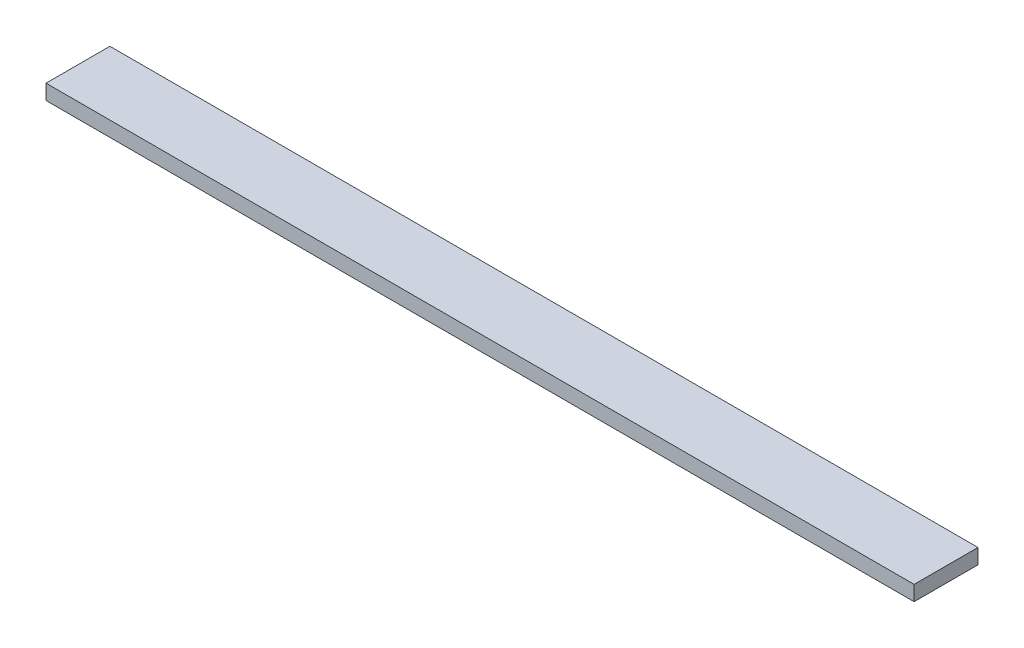
ISO-10303-21;
HEADER;
FILE_DESCRIPTION(('STEP AP214'),'2;1');
FILE_NAME('part.step','',(''),(''),'','','');
FILE_SCHEMA(('AUTOMOTIVE_DESIGN { 1 0 10303 214 1 1 1 1 }'));
ENDSEC;
DATA;
#1=APPLICATION_CONTEXT('core data for automotive mechanical design processes');
#2=APPLICATION_PROTOCOL_DEFINITION('international standard','automotive_design',2000,#1);
#3=PRODUCT_CONTEXT('',#1,'mechanical');
#4=PRODUCT('Part','Part','',(#3));
#5=PRODUCT_RELATED_PRODUCT_CATEGORY('part','',(#4));
#6=PRODUCT_DEFINITION_FORMATION('','',#4);
#7=PRODUCT_DEFINITION_CONTEXT('part definition',#1,'design');
#8=PRODUCT_DEFINITION('design','',#6,#7);
#9=PRODUCT_DEFINITION_SHAPE('','',#8);
#10=(LENGTH_UNIT() NAMED_UNIT(*) SI_UNIT(.MILLI.,.METRE.));
#11=(NAMED_UNIT(*) PLANE_ANGLE_UNIT() SI_UNIT($,.RADIAN.));
#12=(NAMED_UNIT(*) SI_UNIT($,.STERADIAN.) SOLID_ANGLE_UNIT());
#13=UNCERTAINTY_MEASURE_WITH_UNIT(LENGTH_MEASURE(1.E-05),#10,'distance_accuracy_value','');
#14=(GEOMETRIC_REPRESENTATION_CONTEXT(3) GLOBAL_UNCERTAINTY_ASSIGNED_CONTEXT((#13)) GLOBAL_UNIT_ASSIGNED_CONTEXT((#10,
#11,#12)) REPRESENTATION_CONTEXT('',''));
#15=CARTESIAN_POINT('',(0.,0.,0.));
#16=DIRECTION('',(0.,0.,1.));
#17=DIRECTION('',(1.,0.,0.));
#18=AXIS2_PLACEMENT_3D('',#15,#16,#17);
#19=CARTESIAN_POINT('',(5775.,200.,-425.));
#20=DIRECTION('',(-1.,0.,0.));
#21=DIRECTION('',(0.,0.,1.));
#22=AXIS2_PLACEMENT_3D('',#19,#20,#21);
#23=PLANE('',#22);
#24=DIRECTION('',(0.,0.,-1.));
#25=VECTOR('',#24,1.);
#26=CARTESIAN_POINT('',(5775.,0.,-425.));
#27=LINE('',#26,#25);
#28=CARTESIAN_POINT('',(5775.,0.,425.));
#29=VERTEX_POINT('',#28);
#30=CARTESIAN_POINT('',(5775.,0.,-425.));
#31=VERTEX_POINT('',#30);
#32=EDGE_CURVE('E95',#29,#31,#27,.T.);
#33=ORIENTED_EDGE('',*,*,#32,.T.);
#34=DIRECTION('',(0.,-1.,0.));
#35=VECTOR('',#34,1.);
#36=CARTESIAN_POINT('',(5775.,200.,-425.));
#37=LINE('',#36,#35);
#38=CARTESIAN_POINT('',(5775.,200.,-425.));
#39=VERTEX_POINT('',#38);
#40=EDGE_CURVE('E11',#39,#31,#37,.T.);
#41=ORIENTED_EDGE('',*,*,#40,.F.);
#42=DIRECTION('',(0.,0.,-1.));
#43=VECTOR('',#42,1.);
#44=CARTESIAN_POINT('',(5775.,200.,-425.));
#45=LINE('',#44,#43);
#46=CARTESIAN_POINT('',(5775.,200.,425.));
#47=VERTEX_POINT('',#46);
#48=EDGE_CURVE('E83',#47,#39,#45,.T.);
#49=ORIENTED_EDGE('',*,*,#48,.F.);
#50=DIRECTION('',(0.,-1.,0.));
#51=VECTOR('',#50,1.);
#52=CARTESIAN_POINT('',(5775.,200.,425.));
#53=LINE('',#52,#51);
#54=EDGE_CURVE('E91',#47,#29,#53,.T.);
#55=ORIENTED_EDGE('',*,*,#54,.T.);
#56=EDGE_LOOP('',(#33,#41,#49,#55));
#57=FACE_BOUND('',#56,.T.);
#58=ADVANCED_FACE('F32',(#57),#23,.F.);
#59=CARTESIAN_POINT('',(-5775.,200.,-425.));
#60=DIRECTION('',(0.,0.,1.));
#61=DIRECTION('',(1.,0.,0.));
#62=AXIS2_PLACEMENT_3D('',#59,#60,#61);
#63=PLANE('',#62);
#64=DIRECTION('',(-1.,0.,0.));
#65=VECTOR('',#64,1.);
#66=CARTESIAN_POINT('',(-5775.,0.,-425.));
#67=LINE('',#66,#65);
#68=CARTESIAN_POINT('',(-5775.,0.,-425.));
#69=VERTEX_POINT('',#68);
#70=EDGE_CURVE('E87',#31,#69,#67,.T.);
#71=ORIENTED_EDGE('',*,*,#70,.T.);
#72=DIRECTION('',(0.,-1.,0.));
#73=VECTOR('',#72,1.);
#74=CARTESIAN_POINT('',(-5775.,200.,-425.));
#75=LINE('',#74,#73);
#76=CARTESIAN_POINT('',(-5775.,200.,-425.));
#77=VERTEX_POINT('',#76);
#78=EDGE_CURVE('E40',#77,#69,#75,.T.);
#79=ORIENTED_EDGE('',*,*,#78,.F.);
#80=DIRECTION('',(-1.,0.,0.));
#81=VECTOR('',#80,1.);
#82=CARTESIAN_POINT('',(-5775.,200.,-425.));
#83=LINE('',#82,#81);
#84=EDGE_CURVE('E78',#39,#77,#83,.T.);
#85=ORIENTED_EDGE('',*,*,#84,.F.);
#86=ORIENTED_EDGE('',*,*,#40,.T.);
#87=EDGE_LOOP('',(#71,#79,#85,#86));
#88=FACE_BOUND('',#87,.T.);
#89=ADVANCED_FACE('F86',(#88),#63,.F.);
#90=CARTESIAN_POINT('',(-5775.,200.,-425.));
#91=DIRECTION('',(1.,0.,0.));
#92=DIRECTION('',(0.,0.,-1.));
#93=AXIS2_PLACEMENT_3D('',#90,#91,#92);
#94=PLANE('',#93);
#95=DIRECTION('',(0.,0.,1.));
#96=VECTOR('',#95,1.);
#97=CARTESIAN_POINT('',(-5775.,0.,-425.));
#98=LINE('',#97,#96);
#99=CARTESIAN_POINT('',(-5775.,0.,425.));
#100=VERTEX_POINT('',#99);
#101=EDGE_CURVE('E65',#69,#100,#98,.T.);
#102=ORIENTED_EDGE('',*,*,#101,.T.);
#103=DIRECTION('',(0.,-1.,0.));
#104=VECTOR('',#103,1.);
#105=CARTESIAN_POINT('',(-5775.,200.,425.));
#106=LINE('',#105,#104);
#107=CARTESIAN_POINT('',(-5775.,200.,425.));
#108=VERTEX_POINT('',#107);
#109=EDGE_CURVE('E88',#108,#100,#106,.T.);
#110=ORIENTED_EDGE('',*,*,#109,.F.);
#111=DIRECTION('',(0.,0.,1.));
#112=VECTOR('',#111,1.);
#113=CARTESIAN_POINT('',(-5775.,200.,-425.));
#114=LINE('',#113,#112);
#115=EDGE_CURVE('E81',#77,#108,#114,.T.);
#116=ORIENTED_EDGE('',*,*,#115,.F.);
#117=ORIENTED_EDGE('',*,*,#78,.T.);
#118=EDGE_LOOP('',(#102,#110,#116,#117));
#119=FACE_BOUND('',#118,.T.);
#120=ADVANCED_FACE('F89',(#119),#94,.F.);
#121=CARTESIAN_POINT('',(-5775.,200.,425.));
#122=DIRECTION('',(0.,0.,-1.));
#123=DIRECTION('',(-1.,0.,0.));
#124=AXIS2_PLACEMENT_3D('',#121,#122,#123);
#125=PLANE('',#124);
#126=DIRECTION('',(1.,0.,0.));
#127=VECTOR('',#126,1.);
#128=CARTESIAN_POINT('',(-5775.,0.,425.));
#129=LINE('',#128,#127);
#130=EDGE_CURVE('E71',#100,#29,#129,.T.);
#131=ORIENTED_EDGE('',*,*,#130,.T.);
#132=ORIENTED_EDGE('',*,*,#54,.F.);
#133=DIRECTION('',(1.,0.,0.));
#134=VECTOR('',#133,1.);
#135=CARTESIAN_POINT('',(-5775.,200.,425.));
#136=LINE('',#135,#134);
#137=EDGE_CURVE('E48',#108,#47,#136,.T.);
#138=ORIENTED_EDGE('',*,*,#137,.F.);
#139=ORIENTED_EDGE('',*,*,#109,.T.);
#140=EDGE_LOOP('',(#131,#132,#138,#139));
#141=FACE_BOUND('',#140,.T.);
#142=ADVANCED_FACE('F102',(#141),#125,.F.);
#143=CARTESIAN_POINT('',(0.,200.,0.));
#144=DIRECTION('',(0.,1.,0.));
#145=DIRECTION('',(0.,0.,1.));
#146=AXIS2_PLACEMENT_3D('',#143,#144,#145);
#147=PLANE('',#146);
#148=ORIENTED_EDGE('',*,*,#48,.T.);
#149=ORIENTED_EDGE('',*,*,#84,.T.);
#150=ORIENTED_EDGE('',*,*,#115,.T.);
#151=ORIENTED_EDGE('',*,*,#137,.T.);
#152=EDGE_LOOP('',(#148,#149,#150,#151));
#153=FACE_BOUND('',#152,.T.);
#154=ADVANCED_FACE('F79',(#153),#147,.T.);
#155=CARTESIAN_POINT('',(0.,0.,0.));
#156=DIRECTION('',(0.,1.,0.));
#157=DIRECTION('',(0.,0.,1.));
#158=AXIS2_PLACEMENT_3D('',#155,#156,#157);
#159=PLANE('',#158);
#160=ORIENTED_EDGE('',*,*,#32,.F.);
#161=ORIENTED_EDGE('',*,*,#130,.F.);
#162=ORIENTED_EDGE('',*,*,#101,.F.);
#163=ORIENTED_EDGE('',*,*,#70,.F.);
#164=EDGE_LOOP('',(#160,#161,#162,#163));
#165=FACE_BOUND('',#164,.T.);
#166=ADVANCED_FACE('F105',(#165),#159,.F.);
#167=CLOSED_SHELL('',(#58,#89,#120,#142,#154,#166));
#168=MANIFOLD_SOLID_BREP('B2',#167);
#169=ADVANCED_BREP_SHAPE_REPRESENTATION('',(#18,#168),#14);
#170=SHAPE_DEFINITION_REPRESENTATION(#9,#169);
ENDSEC;
END-ISO-10303-21;
